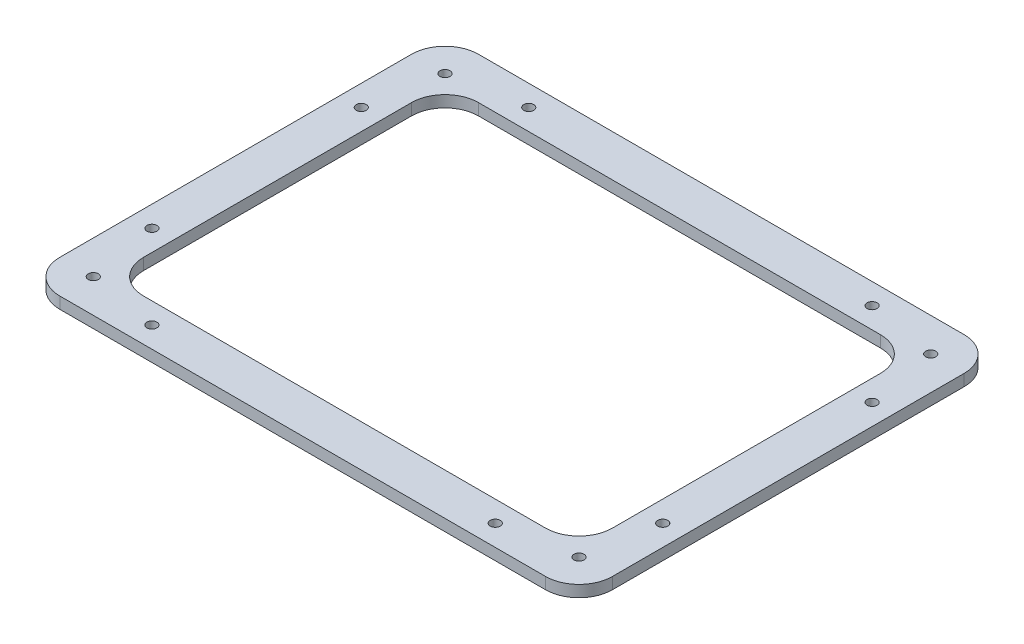
ISO-10303-21;
HEADER;
FILE_DESCRIPTION(('STEP AP214'),'2;1');
FILE_NAME('part.step','',(''),(''),'','','');
FILE_SCHEMA(('AUTOMOTIVE_DESIGN { 1 0 10303 214 1 1 1 1 }'));
ENDSEC;
DATA;
#1=APPLICATION_CONTEXT('core data for automotive mechanical design processes');
#2=APPLICATION_PROTOCOL_DEFINITION('international standard','automotive_design',2000,#1);
#3=PRODUCT_CONTEXT('',#1,'mechanical');
#4=PRODUCT('Part','Part','',(#3));
#5=PRODUCT_RELATED_PRODUCT_CATEGORY('part','',(#4));
#6=PRODUCT_DEFINITION_FORMATION('','',#4);
#7=PRODUCT_DEFINITION_CONTEXT('part definition',#1,'design');
#8=PRODUCT_DEFINITION('design','',#6,#7);
#9=PRODUCT_DEFINITION_SHAPE('','',#8);
#10=(LENGTH_UNIT() NAMED_UNIT(*) SI_UNIT(.MILLI.,.METRE.));
#11=(NAMED_UNIT(*) PLANE_ANGLE_UNIT() SI_UNIT($,.RADIAN.));
#12=(NAMED_UNIT(*) SI_UNIT($,.STERADIAN.) SOLID_ANGLE_UNIT());
#13=UNCERTAINTY_MEASURE_WITH_UNIT(LENGTH_MEASURE(1.E-05),#10,'distance_accuracy_value','');
#14=(GEOMETRIC_REPRESENTATION_CONTEXT(3) GLOBAL_UNCERTAINTY_ASSIGNED_CONTEXT((#13)) GLOBAL_UNIT_ASSIGNED_CONTEXT((#10,
#11,#12)) REPRESENTATION_CONTEXT('',''));
#15=CARTESIAN_POINT('',(0.,0.,0.));
#16=DIRECTION('',(0.,0.,1.));
#17=DIRECTION('',(1.,0.,0.));
#18=AXIS2_PLACEMENT_3D('',#15,#16,#17);
#19=CARTESIAN_POINT('',(-165.,6.9,125.));
#20=DIRECTION('',(1.,0.,0.));
#21=DIRECTION('',(0.,0.,-1.));
#22=AXIS2_PLACEMENT_3D('',#19,#20,#21);
#23=PLANE('',#22);
#24=DIRECTION('',(0.,0.,1.));
#25=VECTOR('',#24,1.);
#26=CARTESIAN_POINT('',(-165.,6.9,125.));
#27=LINE('',#26,#25);
#28=CARTESIAN_POINT('',(-165.,6.9,-105.));
#29=VERTEX_POINT('',#28);
#30=CARTESIAN_POINT('',(-165.,6.9,105.));
#31=VERTEX_POINT('',#30);
#32=EDGE_CURVE('E178',#29,#31,#27,.T.);
#33=ORIENTED_EDGE('',*,*,#32,.F.);
#34=DIRECTION('',(0.,-1.,0.));
#35=VECTOR('',#34,1.);
#36=CARTESIAN_POINT('',(-165.,6.9,-105.));
#37=LINE('',#36,#35);
#38=CARTESIAN_POINT('',(-165.,0.,-105.));
#39=VERTEX_POINT('',#38);
#40=EDGE_CURVE('E206',#29,#39,#37,.T.);
#41=ORIENTED_EDGE('',*,*,#40,.T.);
#42=DIRECTION('',(0.,0.,1.));
#43=VECTOR('',#42,1.);
#44=CARTESIAN_POINT('',(-165.,0.,125.));
#45=LINE('',#44,#43);
#46=CARTESIAN_POINT('',(-165.,0.,105.));
#47=VERTEX_POINT('',#46);
#48=EDGE_CURVE('E308',#39,#47,#45,.T.);
#49=ORIENTED_EDGE('',*,*,#48,.T.);
#50=DIRECTION('',(0.,-1.,0.));
#51=VECTOR('',#50,1.);
#52=CARTESIAN_POINT('',(-165.,6.9,105.));
#53=LINE('',#52,#51);
#54=EDGE_CURVE('E204',#47,#31,#53,.F.);
#55=ORIENTED_EDGE('',*,*,#54,.T.);
#56=EDGE_LOOP('',(#33,#41,#49,#55));
#57=FACE_BOUND('',#56,.T.);
#58=ADVANCED_FACE('F38',(#57),#23,.F.);
#59=CARTESIAN_POINT('',(-165.,6.9,125.));
#60=DIRECTION('',(0.,0.,-1.));
#61=DIRECTION('',(-1.,0.,0.));
#62=AXIS2_PLACEMENT_3D('',#59,#60,#61);
#63=PLANE('',#62);
#64=DIRECTION('',(1.,0.,0.));
#65=VECTOR('',#64,1.);
#66=CARTESIAN_POINT('',(-165.,6.9,125.));
#67=LINE('',#66,#65);
#68=CARTESIAN_POINT('',(-145.,6.9,125.));
#69=VERTEX_POINT('',#68);
#70=CARTESIAN_POINT('',(145.,6.9,125.));
#71=VERTEX_POINT('',#70);
#72=EDGE_CURVE('E182',#69,#71,#67,.T.);
#73=ORIENTED_EDGE('',*,*,#72,.F.);
#74=DIRECTION('',(0.,-1.,0.));
#75=VECTOR('',#74,1.);
#76=CARTESIAN_POINT('',(-145.,6.9,125.));
#77=LINE('',#76,#75);
#78=CARTESIAN_POINT('',(-145.,0.,125.));
#79=VERTEX_POINT('',#78);
#80=EDGE_CURVE('E211',#69,#79,#77,.T.);
#81=ORIENTED_EDGE('',*,*,#80,.T.);
#82=DIRECTION('',(1.,0.,0.));
#83=VECTOR('',#82,1.);
#84=CARTESIAN_POINT('',(-165.,0.,125.));
#85=LINE('',#84,#83);
#86=CARTESIAN_POINT('',(145.,0.,125.));
#87=VERTEX_POINT('',#86);
#88=EDGE_CURVE('E184',#79,#87,#85,.T.);
#89=ORIENTED_EDGE('',*,*,#88,.T.);
#90=DIRECTION('',(0.,-1.,0.));
#91=VECTOR('',#90,1.);
#92=CARTESIAN_POINT('',(145.,6.9,125.));
#93=LINE('',#92,#91);
#94=EDGE_CURVE('E209',#87,#71,#93,.F.);
#95=ORIENTED_EDGE('',*,*,#94,.T.);
#96=EDGE_LOOP('',(#73,#81,#89,#95));
#97=FACE_BOUND('',#96,.T.);
#98=ADVANCED_FACE('F323',(#97),#63,.F.);
#99=CARTESIAN_POINT('',(165.,6.9,125.));
#100=DIRECTION('',(-1.,0.,0.));
#101=DIRECTION('',(0.,0.,1.));
#102=AXIS2_PLACEMENT_3D('',#99,#100,#101);
#103=PLANE('',#102);
#104=DIRECTION('',(0.,0.,-1.));
#105=VECTOR('',#104,1.);
#106=CARTESIAN_POINT('',(165.,0.,125.));
#107=LINE('',#106,#105);
#108=CARTESIAN_POINT('',(165.,0.,105.));
#109=VERTEX_POINT('',#108);
#110=CARTESIAN_POINT('',(165.,0.,-105.));
#111=VERTEX_POINT('',#110);
#112=EDGE_CURVE('E179',#109,#111,#107,.T.);
#113=ORIENTED_EDGE('',*,*,#112,.T.);
#114=DIRECTION('',(0.,-1.,0.));
#115=VECTOR('',#114,1.);
#116=CARTESIAN_POINT('',(165.,6.9,-105.));
#117=LINE('',#116,#115);
#118=CARTESIAN_POINT('',(165.,6.9,-105.));
#119=VERTEX_POINT('',#118);
#120=EDGE_CURVE('E157',#111,#119,#117,.F.);
#121=ORIENTED_EDGE('',*,*,#120,.T.);
#122=DIRECTION('',(0.,0.,-1.));
#123=VECTOR('',#122,1.);
#124=CARTESIAN_POINT('',(165.,6.9,125.));
#125=LINE('',#124,#123);
#126=CARTESIAN_POINT('',(165.,6.9,105.));
#127=VERTEX_POINT('',#126);
#128=EDGE_CURVE('E313',#127,#119,#125,.T.);
#129=ORIENTED_EDGE('',*,*,#128,.F.);
#130=DIRECTION('',(0.,-1.,0.));
#131=VECTOR('',#130,1.);
#132=CARTESIAN_POINT('',(165.,6.9,105.));
#133=LINE('',#132,#131);
#134=EDGE_CURVE('E162',#127,#109,#133,.T.);
#135=ORIENTED_EDGE('',*,*,#134,.T.);
#136=EDGE_LOOP('',(#113,#121,#129,#135));
#137=FACE_BOUND('',#136,.T.);
#138=ADVANCED_FACE('F332',(#137),#103,.F.);
#139=CARTESIAN_POINT('',(-165.,6.9,-125.));
#140=DIRECTION('',(0.,0.,1.));
#141=DIRECTION('',(1.,0.,0.));
#142=AXIS2_PLACEMENT_3D('',#139,#140,#141);
#143=PLANE('',#142);
#144=DIRECTION('',(-1.,0.,0.));
#145=VECTOR('',#144,1.);
#146=CARTESIAN_POINT('',(-165.,6.9,-125.));
#147=LINE('',#146,#145);
#148=CARTESIAN_POINT('',(145.,6.9,-125.));
#149=VERTEX_POINT('',#148);
#150=CARTESIAN_POINT('',(-145.,6.9,-125.));
#151=VERTEX_POINT('',#150);
#152=EDGE_CURVE('E172',#149,#151,#147,.T.);
#153=ORIENTED_EDGE('',*,*,#152,.F.);
#154=DIRECTION('',(0.,-1.,0.));
#155=VECTOR('',#154,1.);
#156=CARTESIAN_POINT('',(145.,6.9,-125.));
#157=LINE('',#156,#155);
#158=CARTESIAN_POINT('',(145.,0.,-125.));
#159=VERTEX_POINT('',#158);
#160=EDGE_CURVE('E156',#149,#159,#157,.T.);
#161=ORIENTED_EDGE('',*,*,#160,.T.);
#162=DIRECTION('',(-1.,0.,0.));
#163=VECTOR('',#162,1.);
#164=CARTESIAN_POINT('',(-165.,0.,-125.));
#165=LINE('',#164,#163);
#166=CARTESIAN_POINT('',(-145.,0.,-125.));
#167=VERTEX_POINT('',#166);
#168=EDGE_CURVE('E169',#159,#167,#165,.T.);
#169=ORIENTED_EDGE('',*,*,#168,.T.);
#170=DIRECTION('',(0.,-1.,0.));
#171=VECTOR('',#170,1.);
#172=CARTESIAN_POINT('',(-145.,6.9,-125.));
#173=LINE('',#172,#171);
#174=EDGE_CURVE('E174',#167,#151,#173,.F.);
#175=ORIENTED_EDGE('',*,*,#174,.T.);
#176=EDGE_LOOP('',(#153,#161,#169,#175));
#177=FACE_BOUND('',#176,.T.);
#178=ADVANCED_FACE('F168',(#177),#143,.F.);
#179=CARTESIAN_POINT('',(0.,6.9,0.));
#180=DIRECTION('',(0.,-1.,0.));
#181=DIRECTION('',(0.,0.,-1.));
#182=AXIS2_PLACEMENT_3D('',#179,#180,#181);
#183=PLANE('',#182);
#184=CARTESIAN_POINT('',(-102.5,6.9,112.5));
#185=DIRECTION('',(0.,1.,0.));
#186=DIRECTION('',(0.,0.,-1.));
#187=AXIS2_PLACEMENT_3D('',#184,#185,#186);
#188=CIRCLE('',#187,2.99999999999993);
#189=CARTESIAN_POINT('',(-102.5,6.9,109.5));
#190=VERTEX_POINT('',#189);
#191=EDGE_CURVE('E465',#190,#190,#188,.T.);
#192=ORIENTED_EDGE('',*,*,#191,.F.);
#193=EDGE_LOOP('',(#192));
#194=FACE_BOUND('',#193,.T.);
#195=CARTESIAN_POINT('',(102.5,6.9,112.5));
#196=DIRECTION('',(0.,1.,0.));
#197=DIRECTION('',(0.,0.,1.));
#198=AXIS2_PLACEMENT_3D('',#195,#196,#197);
#199=CIRCLE('',#198,2.99999999999993);
#200=CARTESIAN_POINT('',(102.5,6.9,115.5));
#201=VERTEX_POINT('',#200);
#202=EDGE_CURVE('E461',#201,#201,#199,.T.);
#203=ORIENTED_EDGE('',*,*,#202,.F.);
#204=EDGE_LOOP('',(#203));
#205=FACE_BOUND('',#204,.T.);
#206=CARTESIAN_POINT('',(152.5,6.9,62.4999999999999));
#207=DIRECTION('',(0.,1.,0.));
#208=DIRECTION('',(0.,0.,-1.));
#209=AXIS2_PLACEMENT_3D('',#206,#207,#208);
#210=CIRCLE('',#209,2.99999999999999);
#211=CARTESIAN_POINT('',(152.5,6.9,59.4999999999999));
#212=VERTEX_POINT('',#211);
#213=EDGE_CURVE('E457',#212,#212,#210,.T.);
#214=ORIENTED_EDGE('',*,*,#213,.F.);
#215=EDGE_LOOP('',(#214));
#216=FACE_BOUND('',#215,.T.);
#217=CARTESIAN_POINT('',(152.5,6.9,-62.4999999999999));
#218=DIRECTION('',(0.,1.,0.));
#219=DIRECTION('',(0.,0.,1.));
#220=AXIS2_PLACEMENT_3D('',#217,#218,#219);
#221=CIRCLE('',#220,2.99999999999999);
#222=CARTESIAN_POINT('',(152.5,6.9,-59.4999999999999));
#223=VERTEX_POINT('',#222);
#224=EDGE_CURVE('E453',#223,#223,#221,.T.);
#225=ORIENTED_EDGE('',*,*,#224,.F.);
#226=EDGE_LOOP('',(#225));
#227=FACE_BOUND('',#226,.T.);
#228=CARTESIAN_POINT('',(102.5,6.9,-112.5));
#229=DIRECTION('',(0.,1.,0.));
#230=DIRECTION('',(0.,0.,-1.));
#231=AXIS2_PLACEMENT_3D('',#228,#229,#230);
#232=CIRCLE('',#231,2.99999999999993);
#233=CARTESIAN_POINT('',(102.5,6.9,-115.5));
#234=VERTEX_POINT('',#233);
#235=EDGE_CURVE('E477',#234,#234,#232,.T.);
#236=ORIENTED_EDGE('',*,*,#235,.F.);
#237=EDGE_LOOP('',(#236));
#238=FACE_BOUND('',#237,.T.);
#239=CARTESIAN_POINT('',(-102.5,6.9,-112.5));
#240=DIRECTION('',(0.,1.,0.));
#241=DIRECTION('',(0.,0.,1.));
#242=AXIS2_PLACEMENT_3D('',#239,#240,#241);
#243=CIRCLE('',#242,2.99999999999993);
#244=CARTESIAN_POINT('',(-102.5,6.9,-109.5));
#245=VERTEX_POINT('',#244);
#246=EDGE_CURVE('E473',#245,#245,#243,.T.);
#247=ORIENTED_EDGE('',*,*,#246,.F.);
#248=EDGE_LOOP('',(#247));
#249=FACE_BOUND('',#248,.T.);
#250=CARTESIAN_POINT('',(-152.5,6.9,-62.4999999999999));
#251=DIRECTION('',(0.,1.,0.));
#252=DIRECTION('',(0.,0.,-1.));
#253=AXIS2_PLACEMENT_3D('',#250,#251,#252);
#254=CIRCLE('',#253,2.99999999999999);
#255=CARTESIAN_POINT('',(-152.5,6.9,-65.4999999999999));
#256=VERTEX_POINT('',#255);
#257=EDGE_CURVE('E469',#256,#256,#254,.T.);
#258=ORIENTED_EDGE('',*,*,#257,.F.);
#259=EDGE_LOOP('',(#258));
#260=FACE_BOUND('',#259,.T.);
#261=CARTESIAN_POINT('',(-152.5,6.9,62.5));
#262=DIRECTION('',(0.,1.,0.));
#263=DIRECTION('',(0.,0.,1.));
#264=AXIS2_PLACEMENT_3D('',#261,#262,#263);
#265=CIRCLE('',#264,2.99999999999999);
#266=CARTESIAN_POINT('',(-152.5,6.9,65.4999999999999));
#267=VERTEX_POINT('',#266);
#268=EDGE_CURVE('E274',#267,#267,#265,.T.);
#269=ORIENTED_EDGE('',*,*,#268,.F.);
#270=EDGE_LOOP('',(#269));
#271=FACE_BOUND('',#270,.T.);
#272=DIRECTION('',(1.,0.,0.));
#273=VECTOR('',#272,1.);
#274=CARTESIAN_POINT('',(-140.,6.9,100.));
#275=LINE('',#274,#273);
#276=CARTESIAN_POINT('',(-120.,6.9,100.));
#277=VERTEX_POINT('',#276);
#278=CARTESIAN_POINT('',(120.,6.9,100.));
#279=VERTEX_POINT('',#278);
#280=EDGE_CURVE('E281',#277,#279,#275,.T.);
#281=ORIENTED_EDGE('',*,*,#280,.F.);
#282=CARTESIAN_POINT('',(-120.,6.9,80.));
#283=DIRECTION('',(0.,-1.,0.));
#284=DIRECTION('',(0.,0.,-1.));
#285=AXIS2_PLACEMENT_3D('',#282,#283,#284);
#286=CIRCLE('',#285,20.);
#287=CARTESIAN_POINT('',(-140.,6.9,80.));
#288=VERTEX_POINT('',#287);
#289=EDGE_CURVE('E233',#277,#288,#286,.T.);
#290=ORIENTED_EDGE('',*,*,#289,.T.);
#291=DIRECTION('',(0.,0.,1.));
#292=VECTOR('',#291,1.);
#293=CARTESIAN_POINT('',(-140.,6.9,-100.));
#294=LINE('',#293,#292);
#295=CARTESIAN_POINT('',(-140.,6.9,-80.));
#296=VERTEX_POINT('',#295);
#297=EDGE_CURVE('E251',#296,#288,#294,.T.);
#298=ORIENTED_EDGE('',*,*,#297,.F.);
#299=CARTESIAN_POINT('',(-120.,6.9,-80.));
#300=DIRECTION('',(0.,-1.,0.));
#301=DIRECTION('',(0.,0.,-1.));
#302=AXIS2_PLACEMENT_3D('',#299,#300,#301);
#303=CIRCLE('',#302,20.);
#304=CARTESIAN_POINT('',(-120.,6.9,-100.));
#305=VERTEX_POINT('',#304);
#306=EDGE_CURVE('E46',#296,#305,#303,.T.);
#307=ORIENTED_EDGE('',*,*,#306,.T.);
#308=DIRECTION('',(-1.,0.,0.));
#309=VECTOR('',#308,1.);
#310=CARTESIAN_POINT('',(-140.,6.9,-100.));
#311=LINE('',#310,#309);
#312=CARTESIAN_POINT('',(120.,6.9,-100.));
#313=VERTEX_POINT('',#312);
#314=EDGE_CURVE('E249',#313,#305,#311,.T.);
#315=ORIENTED_EDGE('',*,*,#314,.F.);
#316=CARTESIAN_POINT('',(120.,6.9,-80.0000000000001));
#317=DIRECTION('',(0.,-1.,0.));
#318=DIRECTION('',(0.,0.,-1.));
#319=AXIS2_PLACEMENT_3D('',#316,#317,#318);
#320=CIRCLE('',#319,20.);
#321=CARTESIAN_POINT('',(140.,6.9,-80.0000000000001));
#322=VERTEX_POINT('',#321);
#323=EDGE_CURVE('E241',#313,#322,#320,.T.);
#324=ORIENTED_EDGE('',*,*,#323,.T.);
#325=DIRECTION('',(0.,0.,-1.));
#326=VECTOR('',#325,1.);
#327=CARTESIAN_POINT('',(140.,6.9,-100.));
#328=LINE('',#327,#326);
#329=CARTESIAN_POINT('',(140.,6.9,80.));
#330=VERTEX_POINT('',#329);
#331=EDGE_CURVE('E257',#330,#322,#328,.T.);
#332=ORIENTED_EDGE('',*,*,#331,.F.);
#333=CARTESIAN_POINT('',(120.,6.9,80.));
#334=DIRECTION('',(0.,-1.,0.));
#335=DIRECTION('',(0.,0.,-1.));
#336=AXIS2_PLACEMENT_3D('',#333,#334,#335);
#337=CIRCLE('',#336,20.);
#338=EDGE_CURVE('E237',#330,#279,#337,.T.);
#339=ORIENTED_EDGE('',*,*,#338,.T.);
#340=EDGE_LOOP('',(#281,#290,#298,#307,#315,#324,#332,#339));
#341=FACE_BOUND('',#340,.T.);
#342=CARTESIAN_POINT('',(-145.,6.9,105.));
#343=DIRECTION('',(0.,1.,0.));
#344=DIRECTION('',(0.,0.,1.));
#345=AXIS2_PLACEMENT_3D('',#342,#343,#344);
#346=CIRCLE('',#345,2.99999999999999);
#347=CARTESIAN_POINT('',(-145.,6.9,108.));
#348=VERTEX_POINT('',#347);
#349=EDGE_CURVE('E279',#348,#348,#346,.T.);
#350=ORIENTED_EDGE('',*,*,#349,.F.);
#351=EDGE_LOOP('',(#350));
#352=FACE_BOUND('',#351,.T.);
#353=CARTESIAN_POINT('',(145.,6.9,105.));
#354=DIRECTION('',(0.,1.,0.));
#355=DIRECTION('',(0.,0.,1.));
#356=AXIS2_PLACEMENT_3D('',#353,#354,#355);
#357=CIRCLE('',#356,2.99999999999999);
#358=CARTESIAN_POINT('',(145.,6.9,108.));
#359=VERTEX_POINT('',#358);
#360=EDGE_CURVE('E297',#359,#359,#357,.T.);
#361=ORIENTED_EDGE('',*,*,#360,.F.);
#362=EDGE_LOOP('',(#361));
#363=FACE_BOUND('',#362,.T.);
#364=CARTESIAN_POINT('',(145.,6.9,-105.));
#365=DIRECTION('',(0.,1.,0.));
#366=DIRECTION('',(0.,0.,1.));
#367=AXIS2_PLACEMENT_3D('',#364,#365,#366);
#368=CIRCLE('',#367,2.99999999999999);
#369=CARTESIAN_POINT('',(145.,6.9,-102.));
#370=VERTEX_POINT('',#369);
#371=EDGE_CURVE('E291',#370,#370,#368,.T.);
#372=ORIENTED_EDGE('',*,*,#371,.F.);
#373=EDGE_LOOP('',(#372));
#374=FACE_BOUND('',#373,.T.);
#375=CARTESIAN_POINT('',(-145.,6.9,-105.));
#376=DIRECTION('',(0.,1.,0.));
#377=DIRECTION('',(0.,0.,1.));
#378=AXIS2_PLACEMENT_3D('',#375,#376,#377);
#379=CIRCLE('',#378,2.99999999999999);
#380=CARTESIAN_POINT('',(-145.,6.9,-102.));
#381=VERTEX_POINT('',#380);
#382=EDGE_CURVE('E290',#381,#381,#379,.T.);
#383=ORIENTED_EDGE('',*,*,#382,.F.);
#384=EDGE_LOOP('',(#383));
#385=FACE_BOUND('',#384,.T.);
#386=ORIENTED_EDGE('',*,*,#128,.T.);
#387=CARTESIAN_POINT('',(145.,6.9,-105.));
#388=DIRECTION('',(0.,-1.,0.));
#389=DIRECTION('',(0.,0.,-1.));
#390=AXIS2_PLACEMENT_3D('',#387,#388,#389);
#391=CIRCLE('',#390,20.);
#392=EDGE_CURVE('E202',#119,#149,#391,.F.);
#393=ORIENTED_EDGE('',*,*,#392,.T.);
#394=ORIENTED_EDGE('',*,*,#152,.T.);
#395=CARTESIAN_POINT('',(-145.,6.9,-105.));
#396=DIRECTION('',(0.,-1.,0.));
#397=DIRECTION('',(0.,0.,-1.));
#398=AXIS2_PLACEMENT_3D('',#395,#396,#397);
#399=CIRCLE('',#398,20.);
#400=EDGE_CURVE('E200',#151,#29,#399,.F.);
#401=ORIENTED_EDGE('',*,*,#400,.T.);
#402=ORIENTED_EDGE('',*,*,#32,.T.);
#403=CARTESIAN_POINT('',(-145.,6.9,105.));
#404=DIRECTION('',(0.,-1.,0.));
#405=DIRECTION('',(0.,0.,-1.));
#406=AXIS2_PLACEMENT_3D('',#403,#404,#405);
#407=CIRCLE('',#406,20.);
#408=EDGE_CURVE('E198',#31,#69,#407,.F.);
#409=ORIENTED_EDGE('',*,*,#408,.T.);
#410=ORIENTED_EDGE('',*,*,#72,.T.);
#411=CARTESIAN_POINT('',(145.,6.9,105.));
#412=DIRECTION('',(0.,-1.,0.));
#413=DIRECTION('',(0.,0.,-1.));
#414=AXIS2_PLACEMENT_3D('',#411,#412,#413);
#415=CIRCLE('',#414,20.);
#416=EDGE_CURVE('E196',#71,#127,#415,.F.);
#417=ORIENTED_EDGE('',*,*,#416,.T.);
#418=EDGE_LOOP('',(#386,#393,#394,#401,#402,#409,#410,#417));
#419=FACE_BOUND('',#418,.T.);
#420=ADVANCED_FACE('F247',(#194,#205,#216,#227,#238,#249,#260,#271,#341,#352,#363,#374,#385,
#419),#183,.F.);
#421=CARTESIAN_POINT('',(0.,0.,0.));
#422=DIRECTION('',(0.,-1.,0.));
#423=DIRECTION('',(0.,0.,-1.));
#424=AXIS2_PLACEMENT_3D('',#421,#422,#423);
#425=PLANE('',#424);
#426=CARTESIAN_POINT('',(-102.5,0.,112.5));
#427=DIRECTION('',(0.,1.,0.));
#428=DIRECTION('',(0.,0.,-1.));
#429=AXIS2_PLACEMENT_3D('',#426,#427,#428);
#430=CIRCLE('',#429,2.99999999999993);
#431=CARTESIAN_POINT('',(-102.5,0.,109.5));
#432=VERTEX_POINT('',#431);
#433=EDGE_CURVE('E423',#432,#432,#430,.T.);
#434=ORIENTED_EDGE('',*,*,#433,.T.);
#435=EDGE_LOOP('',(#434));
#436=FACE_BOUND('',#435,.T.);
#437=CARTESIAN_POINT('',(102.5,0.,112.5));
#438=DIRECTION('',(0.,1.,0.));
#439=DIRECTION('',(0.,0.,1.));
#440=AXIS2_PLACEMENT_3D('',#437,#438,#439);
#441=CIRCLE('',#440,2.99999999999993);
#442=CARTESIAN_POINT('',(102.5,0.,115.5));
#443=VERTEX_POINT('',#442);
#444=EDGE_CURVE('E427',#443,#443,#441,.T.);
#445=ORIENTED_EDGE('',*,*,#444,.T.);
#446=EDGE_LOOP('',(#445));
#447=FACE_BOUND('',#446,.T.);
#448=CARTESIAN_POINT('',(152.5,0.,62.4999999999999));
#449=DIRECTION('',(0.,1.,0.));
#450=DIRECTION('',(0.,0.,-1.));
#451=AXIS2_PLACEMENT_3D('',#448,#449,#450);
#452=CIRCLE('',#451,2.99999999999999);
#453=CARTESIAN_POINT('',(152.5,0.,59.4999999999999));
#454=VERTEX_POINT('',#453);
#455=EDGE_CURVE('E431',#454,#454,#452,.T.);
#456=ORIENTED_EDGE('',*,*,#455,.T.);
#457=EDGE_LOOP('',(#456));
#458=FACE_BOUND('',#457,.T.);
#459=CARTESIAN_POINT('',(152.5,0.,-62.4999999999999));
#460=DIRECTION('',(0.,1.,0.));
#461=DIRECTION('',(0.,0.,1.));
#462=AXIS2_PLACEMENT_3D('',#459,#460,#461);
#463=CIRCLE('',#462,2.99999999999999);
#464=CARTESIAN_POINT('',(152.5,0.,-59.4999999999999));
#465=VERTEX_POINT('',#464);
#466=EDGE_CURVE('E435',#465,#465,#463,.T.);
#467=ORIENTED_EDGE('',*,*,#466,.T.);
#468=EDGE_LOOP('',(#467));
#469=FACE_BOUND('',#468,.T.);
#470=CARTESIAN_POINT('',(102.5,0.,-112.5));
#471=DIRECTION('',(0.,1.,0.));
#472=DIRECTION('',(0.,0.,-1.));
#473=AXIS2_PLACEMENT_3D('',#470,#471,#472);
#474=CIRCLE('',#473,2.99999999999993);
#475=CARTESIAN_POINT('',(102.5,0.,-115.5));
#476=VERTEX_POINT('',#475);
#477=EDGE_CURVE('E439',#476,#476,#474,.T.);
#478=ORIENTED_EDGE('',*,*,#477,.T.);
#479=EDGE_LOOP('',(#478));
#480=FACE_BOUND('',#479,.T.);
#481=CARTESIAN_POINT('',(-102.5,0.,-112.5));
#482=DIRECTION('',(0.,1.,0.));
#483=DIRECTION('',(0.,0.,1.));
#484=AXIS2_PLACEMENT_3D('',#481,#482,#483);
#485=CIRCLE('',#484,2.99999999999993);
#486=CARTESIAN_POINT('',(-102.5,0.,-109.5));
#487=VERTEX_POINT('',#486);
#488=EDGE_CURVE('E443',#487,#487,#485,.T.);
#489=ORIENTED_EDGE('',*,*,#488,.T.);
#490=EDGE_LOOP('',(#489));
#491=FACE_BOUND('',#490,.T.);
#492=CARTESIAN_POINT('',(-152.5,0.,-62.4999999999999));
#493=DIRECTION('',(0.,1.,0.));
#494=DIRECTION('',(0.,0.,-1.));
#495=AXIS2_PLACEMENT_3D('',#492,#493,#494);
#496=CIRCLE('',#495,2.99999999999999);
#497=CARTESIAN_POINT('',(-152.5,0.,-65.4999999999999));
#498=VERTEX_POINT('',#497);
#499=EDGE_CURVE('E447',#498,#498,#496,.T.);
#500=ORIENTED_EDGE('',*,*,#499,.T.);
#501=EDGE_LOOP('',(#500));
#502=FACE_BOUND('',#501,.T.);
#503=CARTESIAN_POINT('',(-152.5,0.,62.5));
#504=DIRECTION('',(0.,1.,0.));
#505=DIRECTION('',(0.,0.,1.));
#506=AXIS2_PLACEMENT_3D('',#503,#504,#505);
#507=CIRCLE('',#506,2.99999999999999);
#508=CARTESIAN_POINT('',(-152.5,0.,65.4999999999999));
#509=VERTEX_POINT('',#508);
#510=EDGE_CURVE('E282',#509,#509,#507,.T.);
#511=ORIENTED_EDGE('',*,*,#510,.T.);
#512=EDGE_LOOP('',(#511));
#513=FACE_BOUND('',#512,.T.);
#514=DIRECTION('',(-1.,0.,0.));
#515=VECTOR('',#514,1.);
#516=CARTESIAN_POINT('',(-140.,0.,-100.));
#517=LINE('',#516,#515);
#518=CARTESIAN_POINT('',(120.,0.,-100.));
#519=VERTEX_POINT('',#518);
#520=CARTESIAN_POINT('',(-120.,0.,-100.));
#521=VERTEX_POINT('',#520);
#522=EDGE_CURVE('E264',#519,#521,#517,.T.);
#523=ORIENTED_EDGE('',*,*,#522,.T.);
#524=CARTESIAN_POINT('',(-120.,0.,-80.));
#525=DIRECTION('',(0.,-1.,0.));
#526=DIRECTION('',(0.,0.,-1.));
#527=AXIS2_PLACEMENT_3D('',#524,#525,#526);
#528=CIRCLE('',#527,20.);
#529=CARTESIAN_POINT('',(-140.,0.,-80.));
#530=VERTEX_POINT('',#529);
#531=EDGE_CURVE('E11',#521,#530,#528,.F.);
#532=ORIENTED_EDGE('',*,*,#531,.T.);
#533=DIRECTION('',(0.,0.,1.));
#534=VECTOR('',#533,1.);
#535=CARTESIAN_POINT('',(-140.,0.,-100.));
#536=LINE('',#535,#534);
#537=CARTESIAN_POINT('',(-140.,0.,80.));
#538=VERTEX_POINT('',#537);
#539=EDGE_CURVE('E256',#530,#538,#536,.T.);
#540=ORIENTED_EDGE('',*,*,#539,.T.);
#541=CARTESIAN_POINT('',(-120.,0.,80.));
#542=DIRECTION('',(0.,-1.,0.));
#543=DIRECTION('',(0.,0.,-1.));
#544=AXIS2_PLACEMENT_3D('',#541,#542,#543);
#545=CIRCLE('',#544,20.);
#546=CARTESIAN_POINT('',(-120.,0.,100.));
#547=VERTEX_POINT('',#546);
#548=EDGE_CURVE('E235',#538,#547,#545,.F.);
#549=ORIENTED_EDGE('',*,*,#548,.T.);
#550=DIRECTION('',(1.,0.,0.));
#551=VECTOR('',#550,1.);
#552=CARTESIAN_POINT('',(-140.,0.,100.));
#553=LINE('',#552,#551);
#554=CARTESIAN_POINT('',(120.,0.,100.));
#555=VERTEX_POINT('',#554);
#556=EDGE_CURVE('E268',#547,#555,#553,.T.);
#557=ORIENTED_EDGE('',*,*,#556,.T.);
#558=CARTESIAN_POINT('',(120.,0.,80.));
#559=DIRECTION('',(0.,-1.,0.));
#560=DIRECTION('',(0.,0.,-1.));
#561=AXIS2_PLACEMENT_3D('',#558,#559,#560);
#562=CIRCLE('',#561,20.);
#563=CARTESIAN_POINT('',(140.,0.,80.));
#564=VERTEX_POINT('',#563);
#565=EDGE_CURVE('E239',#555,#564,#562,.F.);
#566=ORIENTED_EDGE('',*,*,#565,.T.);
#567=DIRECTION('',(0.,0.,-1.));
#568=VECTOR('',#567,1.);
#569=CARTESIAN_POINT('',(140.,0.,-100.));
#570=LINE('',#569,#568);
#571=CARTESIAN_POINT('',(140.,0.,-80.0000000000001));
#572=VERTEX_POINT('',#571);
#573=EDGE_CURVE('E271',#564,#572,#570,.T.);
#574=ORIENTED_EDGE('',*,*,#573,.T.);
#575=CARTESIAN_POINT('',(120.,0.,-80.0000000000001));
#576=DIRECTION('',(0.,-1.,0.));
#577=DIRECTION('',(0.,0.,-1.));
#578=AXIS2_PLACEMENT_3D('',#575,#576,#577);
#579=CIRCLE('',#578,20.);
#580=EDGE_CURVE('E60',#572,#519,#579,.F.);
#581=ORIENTED_EDGE('',*,*,#580,.T.);
#582=EDGE_LOOP('',(#523,#532,#540,#549,#557,#566,#574,#581));
#583=FACE_BOUND('',#582,.T.);
#584=CARTESIAN_POINT('',(-145.,0.,105.));
#585=DIRECTION('',(0.,1.,0.));
#586=DIRECTION('',(0.,0.,1.));
#587=AXIS2_PLACEMENT_3D('',#584,#585,#586);
#588=CIRCLE('',#587,2.99999999999999);
#589=CARTESIAN_POINT('',(-145.,0.,108.));
#590=VERTEX_POINT('',#589);
#591=EDGE_CURVE('E300',#590,#590,#588,.T.);
#592=ORIENTED_EDGE('',*,*,#591,.T.);
#593=EDGE_LOOP('',(#592));
#594=FACE_BOUND('',#593,.T.);
#595=CARTESIAN_POINT('',(145.,0.,105.));
#596=DIRECTION('',(0.,1.,0.));
#597=DIRECTION('',(0.,0.,1.));
#598=AXIS2_PLACEMENT_3D('',#595,#596,#597);
#599=CIRCLE('',#598,2.99999999999999);
#600=CARTESIAN_POINT('',(145.,0.,108.));
#601=VERTEX_POINT('',#600);
#602=EDGE_CURVE('E294',#601,#601,#599,.T.);
#603=ORIENTED_EDGE('',*,*,#602,.T.);
#604=EDGE_LOOP('',(#603));
#605=FACE_BOUND('',#604,.T.);
#606=CARTESIAN_POINT('',(145.,0.,-105.));
#607=DIRECTION('',(0.,1.,0.));
#608=DIRECTION('',(0.,0.,1.));
#609=AXIS2_PLACEMENT_3D('',#606,#607,#608);
#610=CIRCLE('',#609,2.99999999999999);
#611=CARTESIAN_POINT('',(145.,0.,-102.));
#612=VERTEX_POINT('',#611);
#613=EDGE_CURVE('E287',#612,#612,#610,.T.);
#614=ORIENTED_EDGE('',*,*,#613,.T.);
#615=EDGE_LOOP('',(#614));
#616=FACE_BOUND('',#615,.T.);
#617=CARTESIAN_POINT('',(-145.,0.,-105.));
#618=DIRECTION('',(0.,1.,0.));
#619=DIRECTION('',(0.,0.,1.));
#620=AXIS2_PLACEMENT_3D('',#617,#618,#619);
#621=CIRCLE('',#620,2.99999999999999);
#622=CARTESIAN_POINT('',(-145.,0.,-102.));
#623=VERTEX_POINT('',#622);
#624=EDGE_CURVE('E305',#623,#623,#621,.T.);
#625=ORIENTED_EDGE('',*,*,#624,.T.);
#626=EDGE_LOOP('',(#625));
#627=FACE_BOUND('',#626,.T.);
#628=ORIENTED_EDGE('',*,*,#168,.F.);
#629=CARTESIAN_POINT('',(145.,0.,-105.));
#630=DIRECTION('',(0.,-1.,0.));
#631=DIRECTION('',(0.,0.,-1.));
#632=AXIS2_PLACEMENT_3D('',#629,#630,#631);
#633=CIRCLE('',#632,20.);
#634=EDGE_CURVE('E152',#159,#111,#633,.T.);
#635=ORIENTED_EDGE('',*,*,#634,.T.);
#636=ORIENTED_EDGE('',*,*,#112,.F.);
#637=CARTESIAN_POINT('',(145.,0.,105.));
#638=DIRECTION('',(0.,-1.,0.));
#639=DIRECTION('',(0.,0.,-1.));
#640=AXIS2_PLACEMENT_3D('',#637,#638,#639);
#641=CIRCLE('',#640,20.);
#642=EDGE_CURVE('E173',#109,#87,#641,.T.);
#643=ORIENTED_EDGE('',*,*,#642,.T.);
#644=ORIENTED_EDGE('',*,*,#88,.F.);
#645=CARTESIAN_POINT('',(-145.,0.,105.));
#646=DIRECTION('',(0.,-1.,0.));
#647=DIRECTION('',(0.,0.,-1.));
#648=AXIS2_PLACEMENT_3D('',#645,#646,#647);
#649=CIRCLE('',#648,20.);
#650=EDGE_CURVE('E190',#79,#47,#649,.T.);
#651=ORIENTED_EDGE('',*,*,#650,.T.);
#652=ORIENTED_EDGE('',*,*,#48,.F.);
#653=CARTESIAN_POINT('',(-145.,0.,-105.));
#654=DIRECTION('',(0.,-1.,0.));
#655=DIRECTION('',(0.,0.,-1.));
#656=AXIS2_PLACEMENT_3D('',#653,#654,#655);
#657=CIRCLE('',#656,20.);
#658=EDGE_CURVE('E163',#39,#167,#657,.T.);
#659=ORIENTED_EDGE('',*,*,#658,.T.);
#660=EDGE_LOOP('',(#628,#635,#636,#643,#644,#651,#652,#659));
#661=FACE_BOUND('',#660,.T.);
#662=ADVANCED_FACE('F176',(#436,#447,#458,#469,#480,#491,#502,#513,#583,#594,#605,#616,#627,
#661),#425,.T.);
#663=CARTESIAN_POINT('',(-145.,0.,-105.));
#664=DIRECTION('',(0.,1.,0.));
#665=DIRECTION('',(0.,0.,1.));
#666=AXIS2_PLACEMENT_3D('',#663,#664,#665);
#667=CYLINDRICAL_SURFACE('',#666,2.99999999999999);
#668=ORIENTED_EDGE('',*,*,#624,.F.);
#669=EDGE_LOOP('',(#668));
#670=FACE_BOUND('',#669,.T.);
#671=ORIENTED_EDGE('',*,*,#382,.T.);
#672=EDGE_LOOP('',(#671));
#673=FACE_BOUND('',#672,.T.);
#674=ADVANCED_FACE('F401',(#670,#673),#667,.F.);
#675=CARTESIAN_POINT('',(145.,0.,-105.));
#676=DIRECTION('',(0.,1.,0.));
#677=DIRECTION('',(0.,0.,1.));
#678=AXIS2_PLACEMENT_3D('',#675,#676,#677);
#679=CYLINDRICAL_SURFACE('',#678,2.99999999999999);
#680=ORIENTED_EDGE('',*,*,#613,.F.);
#681=EDGE_LOOP('',(#680));
#682=FACE_BOUND('',#681,.T.);
#683=ORIENTED_EDGE('',*,*,#371,.T.);
#684=EDGE_LOOP('',(#683));
#685=FACE_BOUND('',#684,.T.);
#686=ADVANCED_FACE('F397',(#682,#685),#679,.F.);
#687=CARTESIAN_POINT('',(145.,0.,105.));
#688=DIRECTION('',(0.,1.,0.));
#689=DIRECTION('',(0.,0.,1.));
#690=AXIS2_PLACEMENT_3D('',#687,#688,#689);
#691=CYLINDRICAL_SURFACE('',#690,2.99999999999999);
#692=ORIENTED_EDGE('',*,*,#602,.F.);
#693=EDGE_LOOP('',(#692));
#694=FACE_BOUND('',#693,.T.);
#695=ORIENTED_EDGE('',*,*,#360,.T.);
#696=EDGE_LOOP('',(#695));
#697=FACE_BOUND('',#696,.T.);
#698=ADVANCED_FACE('F400',(#694,#697),#691,.F.);
#699=CARTESIAN_POINT('',(-145.,0.,105.));
#700=DIRECTION('',(0.,1.,0.));
#701=DIRECTION('',(0.,0.,1.));
#702=AXIS2_PLACEMENT_3D('',#699,#700,#701);
#703=CYLINDRICAL_SURFACE('',#702,2.99999999999999);
#704=ORIENTED_EDGE('',*,*,#591,.F.);
#705=EDGE_LOOP('',(#704));
#706=FACE_BOUND('',#705,.T.);
#707=ORIENTED_EDGE('',*,*,#349,.T.);
#708=EDGE_LOOP('',(#707));
#709=FACE_BOUND('',#708,.T.);
#710=ADVANCED_FACE('F396',(#706,#709),#703,.F.);
#711=CARTESIAN_POINT('',(-140.,0.,-100.));
#712=DIRECTION('',(-1.,0.,0.));
#713=DIRECTION('',(0.,0.,1.));
#714=AXIS2_PLACEMENT_3D('',#711,#712,#713);
#715=PLANE('',#714);
#716=ORIENTED_EDGE('',*,*,#297,.T.);
#717=DIRECTION('',(0.,1.,0.));
#718=VECTOR('',#717,1.);
#719=CARTESIAN_POINT('',(-140.,0.,80.));
#720=LINE('',#719,#718);
#721=EDGE_CURVE('E222',#288,#538,#720,.F.);
#722=ORIENTED_EDGE('',*,*,#721,.T.);
#723=ORIENTED_EDGE('',*,*,#539,.F.);
#724=DIRECTION('',(0.,1.,0.));
#725=VECTOR('',#724,1.);
#726=CARTESIAN_POINT('',(-140.,6.9,-80.));
#727=LINE('',#726,#725);
#728=EDGE_CURVE('E219',#530,#296,#727,.T.);
#729=ORIENTED_EDGE('',*,*,#728,.T.);
#730=EDGE_LOOP('',(#716,#722,#723,#729));
#731=FACE_BOUND('',#730,.T.);
#732=ADVANCED_FACE('F266',(#731),#715,.F.);
#733=CARTESIAN_POINT('',(-140.,0.,-100.));
#734=DIRECTION('',(0.,0.,-1.));
#735=DIRECTION('',(-1.,0.,0.));
#736=AXIS2_PLACEMENT_3D('',#733,#734,#735);
#737=PLANE('',#736);
#738=ORIENTED_EDGE('',*,*,#522,.F.);
#739=DIRECTION('',(0.,1.,0.));
#740=VECTOR('',#739,1.);
#741=CARTESIAN_POINT('',(120.,6.9,-100.));
#742=LINE('',#741,#740);
#743=EDGE_CURVE('E230',#519,#313,#742,.T.);
#744=ORIENTED_EDGE('',*,*,#743,.T.);
#745=ORIENTED_EDGE('',*,*,#314,.T.);
#746=DIRECTION('',(0.,1.,0.));
#747=VECTOR('',#746,1.);
#748=CARTESIAN_POINT('',(-120.,0.,-100.));
#749=LINE('',#748,#747);
#750=EDGE_CURVE('E53',#305,#521,#749,.F.);
#751=ORIENTED_EDGE('',*,*,#750,.T.);
#752=EDGE_LOOP('',(#738,#744,#745,#751));
#753=FACE_BOUND('',#752,.T.);
#754=ADVANCED_FACE('F254',(#753),#737,.F.);
#755=CARTESIAN_POINT('',(140.,0.,-100.));
#756=DIRECTION('',(1.,0.,0.));
#757=DIRECTION('',(0.,0.,-1.));
#758=AXIS2_PLACEMENT_3D('',#755,#756,#757);
#759=PLANE('',#758);
#760=ORIENTED_EDGE('',*,*,#573,.F.);
#761=DIRECTION('',(0.,1.,0.));
#762=VECTOR('',#761,1.);
#763=CARTESIAN_POINT('',(140.,6.9,80.));
#764=LINE('',#763,#762);
#765=EDGE_CURVE('E226',#564,#330,#764,.T.);
#766=ORIENTED_EDGE('',*,*,#765,.T.);
#767=ORIENTED_EDGE('',*,*,#331,.T.);
#768=DIRECTION('',(0.,1.,0.));
#769=VECTOR('',#768,1.);
#770=CARTESIAN_POINT('',(140.,0.,-80.0000000000001));
#771=LINE('',#770,#769);
#772=EDGE_CURVE('E224',#322,#572,#771,.F.);
#773=ORIENTED_EDGE('',*,*,#772,.T.);
#774=EDGE_LOOP('',(#760,#766,#767,#773));
#775=FACE_BOUND('',#774,.T.);
#776=ADVANCED_FACE('F379',(#775),#759,.F.);
#777=CARTESIAN_POINT('',(-140.,0.,100.));
#778=DIRECTION('',(0.,0.,1.));
#779=DIRECTION('',(1.,0.,0.));
#780=AXIS2_PLACEMENT_3D('',#777,#778,#779);
#781=PLANE('',#780);
#782=ORIENTED_EDGE('',*,*,#556,.F.);
#783=DIRECTION('',(0.,1.,0.));
#784=VECTOR('',#783,1.);
#785=CARTESIAN_POINT('',(-120.,6.9,100.));
#786=LINE('',#785,#784);
#787=EDGE_CURVE('E216',#547,#277,#786,.T.);
#788=ORIENTED_EDGE('',*,*,#787,.T.);
#789=ORIENTED_EDGE('',*,*,#280,.T.);
#790=DIRECTION('',(0.,1.,0.));
#791=VECTOR('',#790,1.);
#792=CARTESIAN_POINT('',(120.,0.,100.));
#793=LINE('',#792,#791);
#794=EDGE_CURVE('E214',#279,#555,#793,.F.);
#795=ORIENTED_EDGE('',*,*,#794,.T.);
#796=EDGE_LOOP('',(#782,#788,#789,#795));
#797=FACE_BOUND('',#796,.T.);
#798=ADVANCED_FACE('F351',(#797),#781,.F.);
#799=CARTESIAN_POINT('',(145.,6.9,-105.));
#800=DIRECTION('',(0.,-1.,0.));
#801=DIRECTION('',(0.,0.,-1.));
#802=AXIS2_PLACEMENT_3D('',#799,#800,#801);
#803=CYLINDRICAL_SURFACE('',#802,20.);
#804=ORIENTED_EDGE('',*,*,#392,.F.);
#805=ORIENTED_EDGE('',*,*,#120,.F.);
#806=ORIENTED_EDGE('',*,*,#634,.F.);
#807=ORIENTED_EDGE('',*,*,#160,.F.);
#808=EDGE_LOOP('',(#804,#805,#806,#807));
#809=FACE_BOUND('',#808,.T.);
#810=ADVANCED_FACE('F155',(#809),#803,.T.);
#811=CARTESIAN_POINT('',(-145.,6.9,-105.));
#812=DIRECTION('',(0.,-1.,0.));
#813=DIRECTION('',(0.,0.,-1.));
#814=AXIS2_PLACEMENT_3D('',#811,#812,#813);
#815=CYLINDRICAL_SURFACE('',#814,20.);
#816=ORIENTED_EDGE('',*,*,#400,.F.);
#817=ORIENTED_EDGE('',*,*,#174,.F.);
#818=ORIENTED_EDGE('',*,*,#658,.F.);
#819=ORIENTED_EDGE('',*,*,#40,.F.);
#820=EDGE_LOOP('',(#816,#817,#818,#819));
#821=FACE_BOUND('',#820,.T.);
#822=ADVANCED_FACE('F350',(#821),#815,.T.);
#823=CARTESIAN_POINT('',(-145.,6.9,105.));
#824=DIRECTION('',(0.,-1.,0.));
#825=DIRECTION('',(0.,0.,-1.));
#826=AXIS2_PLACEMENT_3D('',#823,#824,#825);
#827=CYLINDRICAL_SURFACE('',#826,20.);
#828=ORIENTED_EDGE('',*,*,#408,.F.);
#829=ORIENTED_EDGE('',*,*,#54,.F.);
#830=ORIENTED_EDGE('',*,*,#650,.F.);
#831=ORIENTED_EDGE('',*,*,#80,.F.);
#832=EDGE_LOOP('',(#828,#829,#830,#831));
#833=FACE_BOUND('',#832,.T.);
#834=ADVANCED_FACE('F354',(#833),#827,.T.);
#835=CARTESIAN_POINT('',(145.,6.9,105.));
#836=DIRECTION('',(0.,-1.,0.));
#837=DIRECTION('',(0.,0.,-1.));
#838=AXIS2_PLACEMENT_3D('',#835,#836,#837);
#839=CYLINDRICAL_SURFACE('',#838,20.);
#840=ORIENTED_EDGE('',*,*,#416,.F.);
#841=ORIENTED_EDGE('',*,*,#94,.F.);
#842=ORIENTED_EDGE('',*,*,#642,.F.);
#843=ORIENTED_EDGE('',*,*,#134,.F.);
#844=EDGE_LOOP('',(#840,#841,#842,#843));
#845=FACE_BOUND('',#844,.T.);
#846=ADVANCED_FACE('F327',(#845),#839,.T.);
#847=CARTESIAN_POINT('',(-120.,0.,80.));
#848=DIRECTION('',(0.,-1.,0.));
#849=DIRECTION('',(0.,0.,-1.));
#850=AXIS2_PLACEMENT_3D('',#847,#848,#849);
#851=CYLINDRICAL_SURFACE('',#850,20.);
#852=ORIENTED_EDGE('',*,*,#548,.F.);
#853=ORIENTED_EDGE('',*,*,#721,.F.);
#854=ORIENTED_EDGE('',*,*,#289,.F.);
#855=ORIENTED_EDGE('',*,*,#787,.F.);
#856=EDGE_LOOP('',(#852,#853,#854,#855));
#857=FACE_BOUND('',#856,.T.);
#858=ADVANCED_FACE('F361',(#857),#851,.F.);
#859=CARTESIAN_POINT('',(120.,0.,80.));
#860=DIRECTION('',(0.,-1.,0.));
#861=DIRECTION('',(0.,0.,-1.));
#862=AXIS2_PLACEMENT_3D('',#859,#860,#861);
#863=CYLINDRICAL_SURFACE('',#862,20.);
#864=ORIENTED_EDGE('',*,*,#565,.F.);
#865=ORIENTED_EDGE('',*,*,#794,.F.);
#866=ORIENTED_EDGE('',*,*,#338,.F.);
#867=ORIENTED_EDGE('',*,*,#765,.F.);
#868=EDGE_LOOP('',(#864,#865,#866,#867));
#869=FACE_BOUND('',#868,.T.);
#870=ADVANCED_FACE('F364',(#869),#863,.F.);
#871=CARTESIAN_POINT('',(120.,0.,-80.0000000000001));
#872=DIRECTION('',(0.,-1.,0.));
#873=DIRECTION('',(0.,0.,-1.));
#874=AXIS2_PLACEMENT_3D('',#871,#872,#873);
#875=CYLINDRICAL_SURFACE('',#874,20.);
#876=ORIENTED_EDGE('',*,*,#580,.F.);
#877=ORIENTED_EDGE('',*,*,#772,.F.);
#878=ORIENTED_EDGE('',*,*,#323,.F.);
#879=ORIENTED_EDGE('',*,*,#743,.F.);
#880=EDGE_LOOP('',(#876,#877,#878,#879));
#881=FACE_BOUND('',#880,.T.);
#882=ADVANCED_FACE('F367',(#881),#875,.F.);
#883=CARTESIAN_POINT('',(-120.,0.,-80.));
#884=DIRECTION('',(0.,-1.,0.));
#885=DIRECTION('',(0.,0.,-1.));
#886=AXIS2_PLACEMENT_3D('',#883,#884,#885);
#887=CYLINDRICAL_SURFACE('',#886,20.);
#888=ORIENTED_EDGE('',*,*,#531,.F.);
#889=ORIENTED_EDGE('',*,*,#750,.F.);
#890=ORIENTED_EDGE('',*,*,#306,.F.);
#891=ORIENTED_EDGE('',*,*,#728,.F.);
#892=EDGE_LOOP('',(#888,#889,#890,#891));
#893=FACE_BOUND('',#892,.T.);
#894=ADVANCED_FACE('F40',(#893),#887,.F.);
#895=CARTESIAN_POINT('',(-152.5,0.,62.5));
#896=DIRECTION('',(0.,1.,0.));
#897=DIRECTION('',(0.,0.,1.));
#898=AXIS2_PLACEMENT_3D('',#895,#896,#897);
#899=CYLINDRICAL_SURFACE('',#898,2.99999999999999);
#900=ORIENTED_EDGE('',*,*,#510,.F.);
#901=EDGE_LOOP('',(#900));
#902=FACE_BOUND('',#901,.T.);
#903=ORIENTED_EDGE('',*,*,#268,.T.);
#904=EDGE_LOOP('',(#903));
#905=FACE_BOUND('',#904,.T.);
#906=ADVANCED_FACE('F374',(#902,#905),#899,.F.);
#907=CARTESIAN_POINT('',(-152.5,0.,-62.4999999999999));
#908=DIRECTION('',(0.,1.,0.));
#909=DIRECTION('',(0.,0.,1.));
#910=AXIS2_PLACEMENT_3D('',#907,#908,#909);
#911=CYLINDRICAL_SURFACE('',#910,2.99999999999999);
#912=ORIENTED_EDGE('',*,*,#499,.F.);
#913=EDGE_LOOP('',(#912));
#914=FACE_BOUND('',#913,.T.);
#915=ORIENTED_EDGE('',*,*,#257,.T.);
#916=EDGE_LOOP('',(#915));
#917=FACE_BOUND('',#916,.T.);
#918=ADVANCED_FACE('F492',(#914,#917),#911,.F.);
#919=CARTESIAN_POINT('',(-102.5,0.,-112.5));
#920=DIRECTION('',(0.,1.,0.));
#921=DIRECTION('',(0.,0.,1.));
#922=AXIS2_PLACEMENT_3D('',#919,#920,#921);
#923=CYLINDRICAL_SURFACE('',#922,2.99999999999993);
#924=ORIENTED_EDGE('',*,*,#488,.F.);
#925=EDGE_LOOP('',(#924));
#926=FACE_BOUND('',#925,.T.);
#927=ORIENTED_EDGE('',*,*,#246,.T.);
#928=EDGE_LOOP('',(#927));
#929=FACE_BOUND('',#928,.T.);
#930=ADVANCED_FACE('F496',(#926,#929),#923,.F.);
#931=CARTESIAN_POINT('',(102.5,0.,-112.5));
#932=DIRECTION('',(0.,1.,0.));
#933=DIRECTION('',(0.,0.,1.));
#934=AXIS2_PLACEMENT_3D('',#931,#932,#933);
#935=CYLINDRICAL_SURFACE('',#934,2.99999999999993);
#936=ORIENTED_EDGE('',*,*,#477,.F.);
#937=EDGE_LOOP('',(#936));
#938=FACE_BOUND('',#937,.T.);
#939=ORIENTED_EDGE('',*,*,#235,.T.);
#940=EDGE_LOOP('',(#939));
#941=FACE_BOUND('',#940,.T.);
#942=ADVANCED_FACE('F482',(#938,#941),#935,.F.);
#943=CARTESIAN_POINT('',(152.5,0.,-62.4999999999999));
#944=DIRECTION('',(0.,1.,0.));
#945=DIRECTION('',(0.,0.,1.));
#946=AXIS2_PLACEMENT_3D('',#943,#944,#945);
#947=CYLINDRICAL_SURFACE('',#946,2.99999999999999);
#948=ORIENTED_EDGE('',*,*,#466,.F.);
#949=EDGE_LOOP('',(#948));
#950=FACE_BOUND('',#949,.T.);
#951=ORIENTED_EDGE('',*,*,#224,.T.);
#952=EDGE_LOOP('',(#951));
#953=FACE_BOUND('',#952,.T.);
#954=ADVANCED_FACE('F500',(#950,#953),#947,.F.);
#955=CARTESIAN_POINT('',(152.5,0.,62.4999999999999));
#956=DIRECTION('',(0.,1.,0.));
#957=DIRECTION('',(0.,0.,1.));
#958=AXIS2_PLACEMENT_3D('',#955,#956,#957);
#959=CYLINDRICAL_SURFACE('',#958,2.99999999999999);
#960=ORIENTED_EDGE('',*,*,#455,.F.);
#961=EDGE_LOOP('',(#960));
#962=FACE_BOUND('',#961,.T.);
#963=ORIENTED_EDGE('',*,*,#213,.T.);
#964=EDGE_LOOP('',(#963));
#965=FACE_BOUND('',#964,.T.);
#966=ADVANCED_FACE('F656',(#962,#965),#959,.F.);
#967=CARTESIAN_POINT('',(102.5,0.,112.5));
#968=DIRECTION('',(0.,1.,0.));
#969=DIRECTION('',(0.,0.,1.));
#970=AXIS2_PLACEMENT_3D('',#967,#968,#969);
#971=CYLINDRICAL_SURFACE('',#970,2.99999999999993);
#972=ORIENTED_EDGE('',*,*,#444,.F.);
#973=EDGE_LOOP('',(#972));
#974=FACE_BOUND('',#973,.T.);
#975=ORIENTED_EDGE('',*,*,#202,.T.);
#976=EDGE_LOOP('',(#975));
#977=FACE_BOUND('',#976,.T.);
#978=ADVANCED_FACE('F664',(#974,#977),#971,.F.);
#979=CARTESIAN_POINT('',(-102.5,0.,112.5));
#980=DIRECTION('',(0.,1.,0.));
#981=DIRECTION('',(0.,0.,1.));
#982=AXIS2_PLACEMENT_3D('',#979,#980,#981);
#983=CYLINDRICAL_SURFACE('',#982,2.99999999999993);
#984=ORIENTED_EDGE('',*,*,#433,.F.);
#985=EDGE_LOOP('',(#984));
#986=FACE_BOUND('',#985,.T.);
#987=ORIENTED_EDGE('',*,*,#191,.T.);
#988=EDGE_LOOP('',(#987));
#989=FACE_BOUND('',#988,.T.);
#990=ADVANCED_FACE('F672',(#986,#989),#983,.F.);
#991=CLOSED_SHELL('',(#58,#98,#138,#178,#420,#662,#674,#686,#698,#710,#732,#754,#776,#798,#810,
#822,#834,#846,#858,#870,#882,#894,#906,#918,#930,#942,#954,#966,#978,#990));
#992=MANIFOLD_SOLID_BREP('B2',#991);
#993=ADVANCED_BREP_SHAPE_REPRESENTATION('',(#18,#992),#14);
#994=SHAPE_DEFINITION_REPRESENTATION(#9,#993);
ENDSEC;
END-ISO-10303-21;
